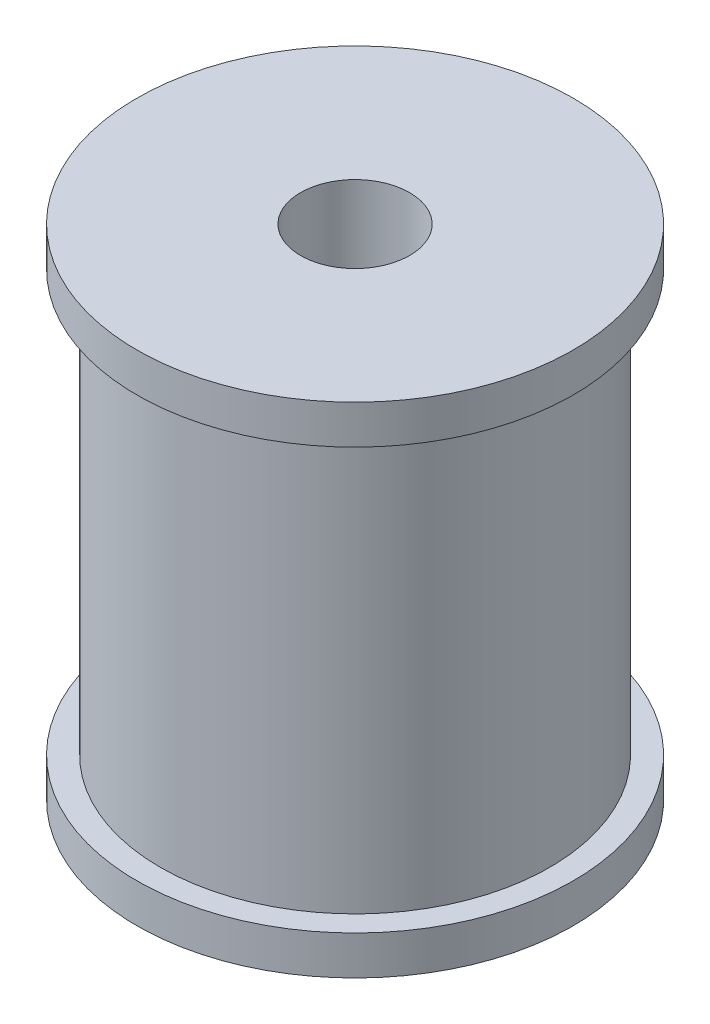
ISO-10303-21;
HEADER;
FILE_DESCRIPTION(('STEP AP214'),'2;1');
FILE_NAME('part.step','',(''),(''),'','','');
FILE_SCHEMA(('AUTOMOTIVE_DESIGN { 1 0 10303 214 1 1 1 1 }'));
ENDSEC;
DATA;
#1=APPLICATION_CONTEXT('core data for automotive mechanical design processes');
#2=APPLICATION_PROTOCOL_DEFINITION('international standard','automotive_design',2000,#1);
#3=PRODUCT_CONTEXT('',#1,'mechanical');
#4=PRODUCT('Part','Part','',(#3));
#5=PRODUCT_RELATED_PRODUCT_CATEGORY('part','',(#4));
#6=PRODUCT_DEFINITION_FORMATION('','',#4);
#7=PRODUCT_DEFINITION_CONTEXT('part definition',#1,'design');
#8=PRODUCT_DEFINITION('design','',#6,#7);
#9=PRODUCT_DEFINITION_SHAPE('','',#8);
#10=(LENGTH_UNIT() NAMED_UNIT(*) SI_UNIT(.MILLI.,.METRE.));
#11=(NAMED_UNIT(*) PLANE_ANGLE_UNIT() SI_UNIT($,.RADIAN.));
#12=(NAMED_UNIT(*) SI_UNIT($,.STERADIAN.) SOLID_ANGLE_UNIT());
#13=UNCERTAINTY_MEASURE_WITH_UNIT(LENGTH_MEASURE(1.E-05),#10,'distance_accuracy_value','');
#14=(GEOMETRIC_REPRESENTATION_CONTEXT(3) GLOBAL_UNCERTAINTY_ASSIGNED_CONTEXT((#13)) GLOBAL_UNIT_ASSIGNED_CONTEXT((#10,
#11,#12)) REPRESENTATION_CONTEXT('',''));
#15=CARTESIAN_POINT('',(0.,0.,0.));
#16=DIRECTION('',(0.,0.,1.));
#17=DIRECTION('',(1.,0.,0.));
#18=AXIS2_PLACEMENT_3D('',#15,#16,#17);
#19=CARTESIAN_POINT('',(14.,32.,0.));
#20=DIRECTION('',(0.,1.,0.));
#21=DIRECTION('',(0.,0.,1.));
#22=AXIS2_PLACEMENT_3D('',#19,#20,#21);
#23=PLANE('',#22);
#24=CARTESIAN_POINT('',(0.,32.,0.));
#25=DIRECTION('',(0.,-1.,0.));
#26=DIRECTION('',(0.,0.,-1.));
#27=AXIS2_PLACEMENT_3D('',#24,#25,#26);
#28=CIRCLE('',#27,3.5);
#29=CARTESIAN_POINT('',(0.,32.,-3.5));
#30=VERTEX_POINT('',#29);
#31=EDGE_CURVE('E10',#30,#30,#28,.T.);
#32=ORIENTED_EDGE('',*,*,#31,.T.);
#33=EDGE_LOOP('',(#32));
#34=FACE_BOUND('',#33,.T.);
#35=CARTESIAN_POINT('',(0.,32.,0.));
#36=DIRECTION('',(0.,-1.,0.));
#37=DIRECTION('',(0.,0.,-1.));
#38=AXIS2_PLACEMENT_3D('',#35,#36,#37);
#39=CIRCLE('',#38,14.);
#40=CARTESIAN_POINT('',(0.,32.,-14.));
#41=VERTEX_POINT('',#40);
#42=EDGE_CURVE('E68',#41,#41,#39,.T.);
#43=ORIENTED_EDGE('',*,*,#42,.F.);
#44=EDGE_LOOP('',(#43));
#45=FACE_BOUND('',#44,.T.);
#46=ADVANCED_FACE('F40',(#34,#45),#23,.T.);
#47=CARTESIAN_POINT('',(0.,0.,0.));
#48=DIRECTION('',(0.,-1.,0.));
#49=DIRECTION('',(0.,0.,-1.));
#50=AXIS2_PLACEMENT_3D('',#47,#48,#49);
#51=CYLINDRICAL_SURFACE('',#50,3.5);
#52=CARTESIAN_POINT('',(0.,0.,0.));
#53=DIRECTION('',(0.,-1.,0.));
#54=DIRECTION('',(0.,0.,-1.));
#55=AXIS2_PLACEMENT_3D('',#52,#53,#54);
#56=CIRCLE('',#55,3.5);
#57=CARTESIAN_POINT('',(0.,0.,-3.5));
#58=VERTEX_POINT('',#57);
#59=EDGE_CURVE('E46',#58,#58,#56,.T.);
#60=ORIENTED_EDGE('',*,*,#59,.T.);
#61=EDGE_LOOP('',(#60));
#62=FACE_BOUND('',#61,.T.);
#63=ORIENTED_EDGE('',*,*,#31,.F.);
#64=EDGE_LOOP('',(#63));
#65=FACE_BOUND('',#64,.T.);
#66=ADVANCED_FACE('F76',(#62,#65),#51,.F.);
#67=CARTESIAN_POINT('',(3.5,0.,0.));
#68=DIRECTION('',(0.,-1.,0.));
#69=DIRECTION('',(0.,0.,-1.));
#70=AXIS2_PLACEMENT_3D('',#67,#68,#69);
#71=PLANE('',#70);
#72=CARTESIAN_POINT('',(0.,0.,0.));
#73=DIRECTION('',(0.,-1.,0.));
#74=DIRECTION('',(0.,0.,-1.));
#75=AXIS2_PLACEMENT_3D('',#72,#73,#74);
#76=CIRCLE('',#75,14.);
#77=CARTESIAN_POINT('',(0.,0.,-14.));
#78=VERTEX_POINT('',#77);
#79=EDGE_CURVE('E50',#78,#78,#76,.T.);
#80=ORIENTED_EDGE('',*,*,#79,.T.);
#81=EDGE_LOOP('',(#80));
#82=FACE_BOUND('',#81,.T.);
#83=ORIENTED_EDGE('',*,*,#59,.F.);
#84=EDGE_LOOP('',(#83));
#85=FACE_BOUND('',#84,.T.);
#86=ADVANCED_FACE('F80',(#82,#85),#71,.T.);
#87=CARTESIAN_POINT('',(0.,0.,0.));
#88=DIRECTION('',(0.,-1.,0.));
#89=DIRECTION('',(0.,0.,-1.));
#90=AXIS2_PLACEMENT_3D('',#87,#88,#89);
#91=CYLINDRICAL_SURFACE('',#90,14.);
#92=CARTESIAN_POINT('',(0.,2.5,0.));
#93=DIRECTION('',(0.,-1.,0.));
#94=DIRECTION('',(0.,0.,-1.));
#95=AXIS2_PLACEMENT_3D('',#92,#93,#94);
#96=CIRCLE('',#95,14.);
#97=CARTESIAN_POINT('',(0.,2.5,-14.));
#98=VERTEX_POINT('',#97);
#99=EDGE_CURVE('E54',#98,#98,#96,.T.);
#100=ORIENTED_EDGE('',*,*,#99,.T.);
#101=EDGE_LOOP('',(#100));
#102=FACE_BOUND('',#101,.T.);
#103=ORIENTED_EDGE('',*,*,#79,.F.);
#104=EDGE_LOOP('',(#103));
#105=FACE_BOUND('',#104,.T.);
#106=ADVANCED_FACE('F84',(#102,#105),#91,.T.);
#107=CARTESIAN_POINT('',(14.,2.5,0.));
#108=DIRECTION('',(0.,1.,0.));
#109=DIRECTION('',(0.,0.,1.));
#110=AXIS2_PLACEMENT_3D('',#107,#108,#109);
#111=PLANE('',#110);
#112=CARTESIAN_POINT('',(0.,2.5,0.));
#113=DIRECTION('',(0.,-1.,0.));
#114=DIRECTION('',(0.,0.,-1.));
#115=AXIS2_PLACEMENT_3D('',#112,#113,#114);
#116=CIRCLE('',#115,12.5);
#117=CARTESIAN_POINT('',(0.,2.5,-12.5));
#118=VERTEX_POINT('',#117);
#119=EDGE_CURVE('E59',#118,#118,#116,.T.);
#120=ORIENTED_EDGE('',*,*,#119,.T.);
#121=EDGE_LOOP('',(#120));
#122=FACE_BOUND('',#121,.T.);
#123=ORIENTED_EDGE('',*,*,#99,.F.);
#124=EDGE_LOOP('',(#123));
#125=FACE_BOUND('',#124,.T.);
#126=ADVANCED_FACE('F91',(#122,#125),#111,.T.);
#127=CARTESIAN_POINT('',(0.,0.,0.));
#128=DIRECTION('',(0.,-1.,0.));
#129=DIRECTION('',(0.,0.,-1.));
#130=AXIS2_PLACEMENT_3D('',#127,#128,#129);
#131=CYLINDRICAL_SURFACE('',#130,12.5);
#132=CARTESIAN_POINT('',(0.,29.5,0.));
#133=DIRECTION('',(0.,-1.,0.));
#134=DIRECTION('',(0.,0.,-1.));
#135=AXIS2_PLACEMENT_3D('',#132,#133,#134);
#136=CIRCLE('',#135,12.5);
#137=CARTESIAN_POINT('',(0.,29.5,-12.5));
#138=VERTEX_POINT('',#137);
#139=EDGE_CURVE('E62',#138,#138,#136,.T.);
#140=ORIENTED_EDGE('',*,*,#139,.T.);
#141=EDGE_LOOP('',(#140));
#142=FACE_BOUND('',#141,.T.);
#143=ORIENTED_EDGE('',*,*,#119,.F.);
#144=EDGE_LOOP('',(#143));
#145=FACE_BOUND('',#144,.T.);
#146=ADVANCED_FACE('F95',(#142,#145),#131,.T.);
#147=CARTESIAN_POINT('',(12.5,29.5,0.));
#148=DIRECTION('',(0.,-1.,0.));
#149=DIRECTION('',(0.,0.,-1.));
#150=AXIS2_PLACEMENT_3D('',#147,#148,#149);
#151=PLANE('',#150);
#152=CARTESIAN_POINT('',(0.,29.5,0.));
#153=DIRECTION('',(0.,-1.,0.));
#154=DIRECTION('',(0.,0.,-1.));
#155=AXIS2_PLACEMENT_3D('',#152,#153,#154);
#156=CIRCLE('',#155,14.);
#157=CARTESIAN_POINT('',(0.,29.5,-14.));
#158=VERTEX_POINT('',#157);
#159=EDGE_CURVE('E65',#158,#158,#156,.T.);
#160=ORIENTED_EDGE('',*,*,#159,.T.);
#161=EDGE_LOOP('',(#160));
#162=FACE_BOUND('',#161,.T.);
#163=ORIENTED_EDGE('',*,*,#139,.F.);
#164=EDGE_LOOP('',(#163));
#165=FACE_BOUND('',#164,.T.);
#166=ADVANCED_FACE('F99',(#162,#165),#151,.T.);
#167=CARTESIAN_POINT('',(0.,0.,0.));
#168=DIRECTION('',(0.,-1.,0.));
#169=DIRECTION('',(0.,0.,-1.));
#170=AXIS2_PLACEMENT_3D('',#167,#168,#169);
#171=CYLINDRICAL_SURFACE('',#170,14.);
#172=ORIENTED_EDGE('',*,*,#42,.T.);
#173=EDGE_LOOP('',(#172));
#174=FACE_BOUND('',#173,.T.);
#175=ORIENTED_EDGE('',*,*,#159,.F.);
#176=EDGE_LOOP('',(#175));
#177=FACE_BOUND('',#176,.T.);
#178=ADVANCED_FACE('F72',(#174,#177),#171,.T.);
#179=CLOSED_SHELL('',(#46,#66,#86,#106,#126,#146,#166,#178));
#180=MANIFOLD_SOLID_BREP('B2',#179);
#181=ADVANCED_BREP_SHAPE_REPRESENTATION('',(#18,#180),#14);
#182=SHAPE_DEFINITION_REPRESENTATION(#9,#181);
ENDSEC;
END-ISO-10303-21;
